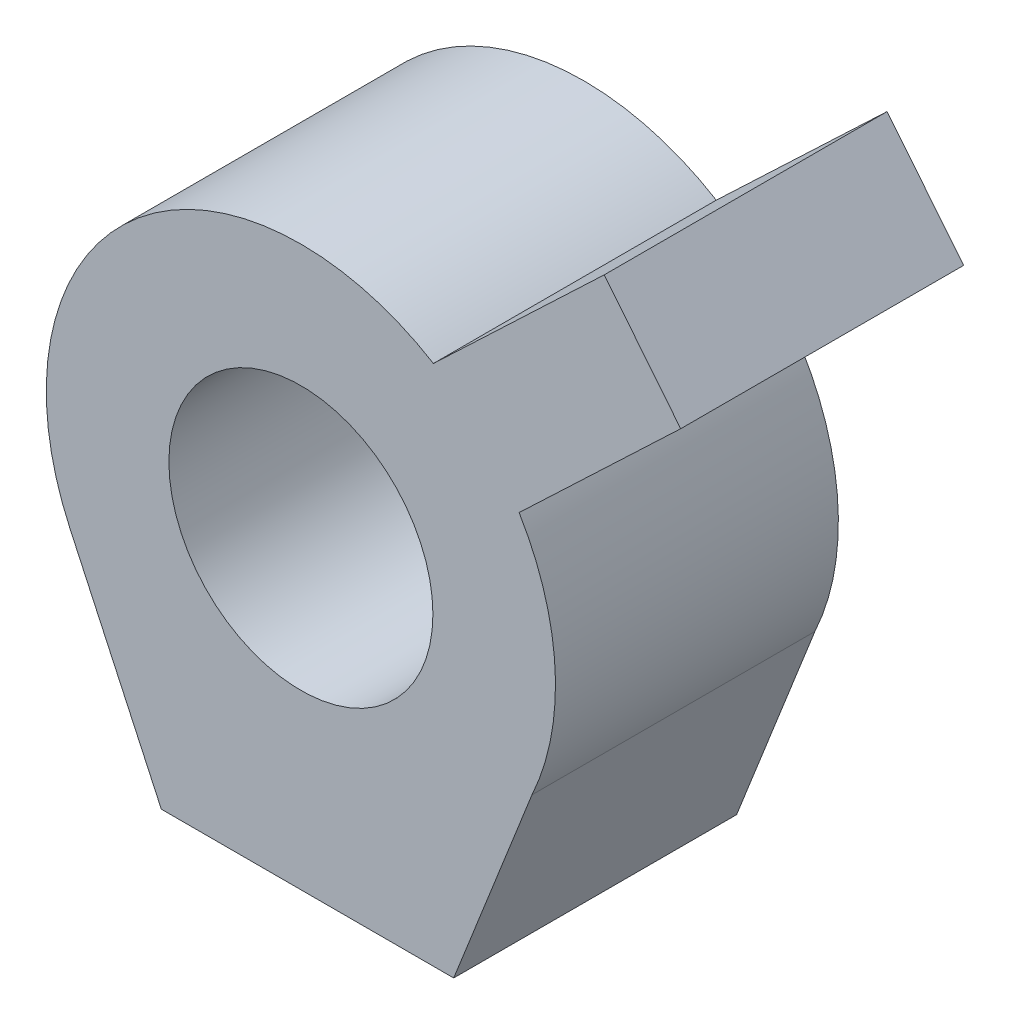
ISO-10303-21;
HEADER;
FILE_DESCRIPTION(('STEP AP214'),'2;1');
FILE_NAME('part.step','',(''),(''),'','','');
FILE_SCHEMA(('AUTOMOTIVE_DESIGN { 1 0 10303 214 1 1 1 1 }'));
ENDSEC;
DATA;
#1=APPLICATION_CONTEXT('core data for automotive mechanical design processes');
#2=APPLICATION_PROTOCOL_DEFINITION('international standard','automotive_design',2000,#1);
#3=PRODUCT_CONTEXT('',#1,'mechanical');
#4=PRODUCT('Part','Part','',(#3));
#5=PRODUCT_RELATED_PRODUCT_CATEGORY('part','',(#4));
#6=PRODUCT_DEFINITION_FORMATION('','',#4);
#7=PRODUCT_DEFINITION_CONTEXT('part definition',#1,'design');
#8=PRODUCT_DEFINITION('design','',#6,#7);
#9=PRODUCT_DEFINITION_SHAPE('','',#8);
#10=(LENGTH_UNIT() NAMED_UNIT(*) SI_UNIT(.MILLI.,.METRE.));
#11=(NAMED_UNIT(*) PLANE_ANGLE_UNIT() SI_UNIT($,.RADIAN.));
#12=(NAMED_UNIT(*) SI_UNIT($,.STERADIAN.) SOLID_ANGLE_UNIT());
#13=UNCERTAINTY_MEASURE_WITH_UNIT(LENGTH_MEASURE(1.E-05),#10,'distance_accuracy_value','');
#14=(GEOMETRIC_REPRESENTATION_CONTEXT(3) GLOBAL_UNCERTAINTY_ASSIGNED_CONTEXT((#13)) GLOBAL_UNIT_ASSIGNED_CONTEXT((#10,
#11,#12)) REPRESENTATION_CONTEXT('',''));
#15=CARTESIAN_POINT('',(0.,0.,0.));
#16=DIRECTION('',(0.,0.,1.));
#17=DIRECTION('',(1.,0.,0.));
#18=AXIS2_PLACEMENT_3D('',#15,#16,#17);
#19=CARTESIAN_POINT('',(0.,0.,23.8125));
#20=DIRECTION('',(0.,0.,1.));
#21=DIRECTION('',(1.,0.,0.));
#22=AXIS2_PLACEMENT_3D('',#19,#20,#21);
#23=PLANE('',#22);
#24=CARTESIAN_POINT('',(0.,0.,23.8125));
#25=DIRECTION('',(0.,0.,1.));
#26=DIRECTION('',(1.,0.,0.));
#27=AXIS2_PLACEMENT_3D('',#24,#25,#26);
#28=CIRCLE('',#27,21.43125);
#29=CARTESIAN_POINT('',(11.1538920492554,18.2999772873099,23.8125));
#30=VERTEX_POINT('',#29);
#31=CARTESIAN_POINT('',(-19.4506025601669,-8.9984741267021,23.8125));
#32=VERTEX_POINT('',#31);
#33=EDGE_CURVE('E164',#30,#32,#28,.T.);
#34=ORIENTED_EDGE('',*,*,#33,.T.);
#35=DIRECTION('',(0.419876308040926,-0.907581338473815,0.));
#36=VECTOR('',#35,1.);
#37=CARTESIAN_POINT('',(-19.4506025601669,-8.9984741267021,23.8125));
#38=LINE('',#37,#36);
#39=CARTESIAN_POINT('',(-11.7497244476854,-25.6442651153864,23.8125));
#40=VERTEX_POINT('',#39);
#41=EDGE_CURVE('E100',#32,#40,#38,.T.);
#42=ORIENTED_EDGE('',*,*,#41,.T.);
#43=DIRECTION('',(1.,0.,0.));
#44=VECTOR('',#43,1.);
#45=CARTESIAN_POINT('',(-11.7497244476854,-25.6442651153864,23.8125));
#46=LINE('',#45,#44);
#47=CARTESIAN_POINT('',(12.86324298528,-25.6442651153864,23.8125));
#48=VERTEX_POINT('',#47);
#49=EDGE_CURVE('E185',#40,#48,#46,.T.);
#50=ORIENTED_EDGE('',*,*,#49,.T.);
#51=DIRECTION('',(0.367971211304057,0.929837183409776,0.));
#52=VECTOR('',#51,1.);
#53=CARTESIAN_POINT('',(12.86324298528,-25.6442651153864,23.8125));
#54=LINE('',#53,#52);
#55=CARTESIAN_POINT('',(19.4506025601669,-8.99847412670211,23.8125));
#56=VERTEX_POINT('',#55);
#57=EDGE_CURVE('E199',#48,#56,#54,.T.);
#58=ORIENTED_EDGE('',*,*,#57,.T.);
#59=CARTESIAN_POINT('',(0.,0.,23.8125));
#60=DIRECTION('',(0.,0.,1.));
#61=DIRECTION('',(1.,0.,0.));
#62=AXIS2_PLACEMENT_3D('',#59,#60,#61);
#63=CIRCLE('',#62,21.43125);
#64=CARTESIAN_POINT('',(18.3692010479282,11.0395167205496,23.8125));
#65=VERTEX_POINT('',#64);
#66=EDGE_CURVE('E119',#56,#65,#63,.T.);
#67=ORIENTED_EDGE('',*,*,#66,.T.);
#68=DIRECTION('',(0.725263803818692,0.688471070467338,0.));
#69=VECTOR('',#68,1.);
#70=CARTESIAN_POINT('',(31.9705409167588,23.9508587315247,23.8125));
#71=LINE('',#70,#69);
#72=CARTESIAN_POINT('',(31.9705409167588,23.9508587315247,23.8125));
#73=VERTEX_POINT('',#72);
#74=EDGE_CURVE('E113',#65,#73,#71,.T.);
#75=ORIENTED_EDGE('',*,*,#74,.T.);
#76=DIRECTION('',(-0.626756914695757,0.779214841928114,0.));
#77=VECTOR('',#76,1.);
#78=CARTESIAN_POINT('',(31.9705409167588,23.9508587315247,23.8125));
#79=LINE('',#78,#77);
#80=CARTESIAN_POINT('',(25.5351405829805,31.9516630884473,23.8125));
#81=VERTEX_POINT('',#80);
#82=EDGE_CURVE('E117',#73,#81,#79,.T.);
#83=ORIENTED_EDGE('',*,*,#82,.T.);
#84=DIRECTION('',(-0.725263803818692,-0.688471070467338,0.));
#85=VECTOR('',#84,1.);
#86=CARTESIAN_POINT('',(11.1538920492554,18.2999772873099,23.8125));
#87=LINE('',#86,#85);
#88=EDGE_CURVE('E57',#81,#30,#87,.T.);
#89=ORIENTED_EDGE('',*,*,#88,.T.);
#90=EDGE_LOOP('',(#34,#42,#50,#58,#67,#75,#83,#89));
#91=FACE_BOUND('',#90,.T.);
#92=CARTESIAN_POINT('',(0.,0.,23.8125));
#93=DIRECTION('',(0.,0.,1.));
#94=DIRECTION('',(1.,0.,0.));
#95=AXIS2_PLACEMENT_3D('',#92,#93,#94);
#96=CIRCLE('',#95,11.1125);
#97=CARTESIAN_POINT('',(11.1125,0.,23.8125));
#98=VERTEX_POINT('',#97);
#99=EDGE_CURVE('E146',#98,#98,#96,.T.);
#100=ORIENTED_EDGE('',*,*,#99,.F.);
#101=EDGE_LOOP('',(#100));
#102=FACE_BOUND('',#101,.T.);
#103=ADVANCED_FACE('F39',(#91,#102),#23,.T.);
#104=CARTESIAN_POINT('',(0.,0.,0.));
#105=DIRECTION('',(0.,0.,1.));
#106=DIRECTION('',(1.,0.,0.));
#107=AXIS2_PLACEMENT_3D('',#104,#105,#106);
#108=PLANE('',#107);
#109=CARTESIAN_POINT('',(0.,0.,0.));
#110=DIRECTION('',(0.,0.,1.));
#111=DIRECTION('',(1.,0.,0.));
#112=AXIS2_PLACEMENT_3D('',#109,#110,#111);
#113=CIRCLE('',#112,21.43125);
#114=CARTESIAN_POINT('',(11.1538920492554,18.2999772873099,0.));
#115=VERTEX_POINT('',#114);
#116=CARTESIAN_POINT('',(-19.4506025601669,-8.9984741267021,0.));
#117=VERTEX_POINT('',#116);
#118=EDGE_CURVE('E141',#115,#117,#113,.T.);
#119=ORIENTED_EDGE('',*,*,#118,.F.);
#120=DIRECTION('',(-0.725263803818692,-0.688471070467338,0.));
#121=VECTOR('',#120,1.);
#122=CARTESIAN_POINT('',(11.1538920492554,18.2999772873099,0.));
#123=LINE('',#122,#121);
#124=CARTESIAN_POINT('',(25.5351405829805,31.9516630884473,0.));
#125=VERTEX_POINT('',#124);
#126=EDGE_CURVE('E92',#125,#115,#123,.T.);
#127=ORIENTED_EDGE('',*,*,#126,.F.);
#128=DIRECTION('',(-0.626756914695757,0.779214841928114,0.));
#129=VECTOR('',#128,1.);
#130=CARTESIAN_POINT('',(31.9705409167588,23.9508587315247,0.));
#131=LINE('',#130,#129);
#132=CARTESIAN_POINT('',(31.9705409167588,23.9508587315247,0.));
#133=VERTEX_POINT('',#132);
#134=EDGE_CURVE('E86',#133,#125,#131,.T.);
#135=ORIENTED_EDGE('',*,*,#134,.F.);
#136=DIRECTION('',(0.725263803818692,0.688471070467338,0.));
#137=VECTOR('',#136,1.);
#138=CARTESIAN_POINT('',(31.9705409167588,23.9508587315247,0.));
#139=LINE('',#138,#137);
#140=CARTESIAN_POINT('',(18.3692010479282,11.0395167205496,0.));
#141=VERTEX_POINT('',#140);
#142=EDGE_CURVE('E128',#141,#133,#139,.T.);
#143=ORIENTED_EDGE('',*,*,#142,.F.);
#144=CARTESIAN_POINT('',(0.,0.,0.));
#145=DIRECTION('',(0.,0.,1.));
#146=DIRECTION('',(1.,0.,0.));
#147=AXIS2_PLACEMENT_3D('',#144,#145,#146);
#148=CIRCLE('',#147,21.43125);
#149=CARTESIAN_POINT('',(19.4506025601669,-8.99847412670211,0.));
#150=VERTEX_POINT('',#149);
#151=EDGE_CURVE('E155',#150,#141,#148,.T.);
#152=ORIENTED_EDGE('',*,*,#151,.F.);
#153=DIRECTION('',(0.367971211304057,0.929837183409776,0.));
#154=VECTOR('',#153,1.);
#155=CARTESIAN_POINT('',(12.86324298528,-25.6442651153864,0.));
#156=LINE('',#155,#154);
#157=CARTESIAN_POINT('',(12.86324298528,-25.6442651153864,0.));
#158=VERTEX_POINT('',#157);
#159=EDGE_CURVE('E152',#158,#150,#156,.T.);
#160=ORIENTED_EDGE('',*,*,#159,.F.);
#161=DIRECTION('',(1.,0.,0.));
#162=VECTOR('',#161,1.);
#163=CARTESIAN_POINT('',(-11.7497244476854,-25.6442651153864,0.));
#164=LINE('',#163,#162);
#165=CARTESIAN_POINT('',(-11.7497244476854,-25.6442651153864,0.));
#166=VERTEX_POINT('',#165);
#167=EDGE_CURVE('E149',#166,#158,#164,.T.);
#168=ORIENTED_EDGE('',*,*,#167,.F.);
#169=DIRECTION('',(0.419876308040926,-0.907581338473815,0.));
#170=VECTOR('',#169,1.);
#171=CARTESIAN_POINT('',(-19.4506025601669,-8.9984741267021,0.));
#172=LINE('',#171,#170);
#173=EDGE_CURVE('E145',#117,#166,#172,.T.);
#174=ORIENTED_EDGE('',*,*,#173,.F.);
#175=EDGE_LOOP('',(#119,#127,#135,#143,#152,#160,#168,#174));
#176=FACE_BOUND('',#175,.T.);
#177=CARTESIAN_POINT('',(0.,0.,0.));
#178=DIRECTION('',(0.,0.,1.));
#179=DIRECTION('',(1.,0.,0.));
#180=AXIS2_PLACEMENT_3D('',#177,#178,#179);
#181=CIRCLE('',#180,11.1125);
#182=CARTESIAN_POINT('',(11.1125,0.,0.));
#183=VERTEX_POINT('',#182);
#184=EDGE_CURVE('E209',#183,#183,#181,.T.);
#185=ORIENTED_EDGE('',*,*,#184,.T.);
#186=EDGE_LOOP('',(#185));
#187=FACE_BOUND('',#186,.T.);
#188=ADVANCED_FACE('F189',(#176,#187),#108,.F.);
#189=CARTESIAN_POINT('',(0.,0.,23.8125));
#190=DIRECTION('',(0.,0.,-1.));
#191=DIRECTION('',(-1.,0.,0.));
#192=AXIS2_PLACEMENT_3D('',#189,#190,#191);
#193=CYLINDRICAL_SURFACE('',#192,21.43125);
#194=ORIENTED_EDGE('',*,*,#118,.T.);
#195=DIRECTION('',(0.,0.,-1.));
#196=VECTOR('',#195,1.);
#197=CARTESIAN_POINT('',(-19.4506025601669,-8.9984741267021,23.8125));
#198=LINE('',#197,#196);
#199=EDGE_CURVE('E11',#32,#117,#198,.T.);
#200=ORIENTED_EDGE('',*,*,#199,.F.);
#201=ORIENTED_EDGE('',*,*,#33,.F.);
#202=DIRECTION('',(0.,0.,-1.));
#203=VECTOR('',#202,1.);
#204=CARTESIAN_POINT('',(11.1538920492554,18.2999772873099,23.8125));
#205=LINE('',#204,#203);
#206=EDGE_CURVE('E137',#30,#115,#205,.T.);
#207=ORIENTED_EDGE('',*,*,#206,.T.);
#208=EDGE_LOOP('',(#194,#200,#201,#207));
#209=FACE_BOUND('',#208,.T.);
#210=ADVANCED_FACE('F41',(#209),#193,.T.);
#211=CARTESIAN_POINT('',(-19.4506025601669,-8.9984741267021,23.8125));
#212=DIRECTION('',(0.907581338473815,0.419876308040926,0.));
#213=DIRECTION('',(-0.419876308040926,0.907581338473815,0.));
#214=AXIS2_PLACEMENT_3D('',#211,#212,#213);
#215=PLANE('',#214);
#216=ORIENTED_EDGE('',*,*,#173,.T.);
#217=DIRECTION('',(0.,0.,-1.));
#218=VECTOR('',#217,1.);
#219=CARTESIAN_POINT('',(-11.7497244476854,-25.6442651153864,23.8125));
#220=LINE('',#219,#218);
#221=EDGE_CURVE('E49',#40,#166,#220,.T.);
#222=ORIENTED_EDGE('',*,*,#221,.F.);
#223=ORIENTED_EDGE('',*,*,#41,.F.);
#224=ORIENTED_EDGE('',*,*,#199,.T.);
#225=EDGE_LOOP('',(#216,#222,#223,#224));
#226=FACE_BOUND('',#225,.T.);
#227=ADVANCED_FACE('F239',(#226),#215,.F.);
#228=CARTESIAN_POINT('',(-11.7497244476854,-25.6442651153864,23.8125));
#229=DIRECTION('',(0.,1.,0.));
#230=DIRECTION('',(0.,0.,1.));
#231=AXIS2_PLACEMENT_3D('',#228,#229,#230);
#232=PLANE('',#231);
#233=ORIENTED_EDGE('',*,*,#167,.T.);
#234=DIRECTION('',(0.,0.,-1.));
#235=VECTOR('',#234,1.);
#236=CARTESIAN_POINT('',(12.86324298528,-25.6442651153864,23.8125));
#237=LINE('',#236,#235);
#238=EDGE_CURVE('E175',#48,#158,#237,.T.);
#239=ORIENTED_EDGE('',*,*,#238,.F.);
#240=ORIENTED_EDGE('',*,*,#49,.F.);
#241=ORIENTED_EDGE('',*,*,#221,.T.);
#242=EDGE_LOOP('',(#233,#239,#240,#241));
#243=FACE_BOUND('',#242,.T.);
#244=ADVANCED_FACE('F183',(#243),#232,.F.);
#245=CARTESIAN_POINT('',(12.86324298528,-25.6442651153864,23.8125));
#246=DIRECTION('',(-0.929837183409776,0.367971211304057,0.));
#247=DIRECTION('',(-0.367971211304057,-0.929837183409776,0.));
#248=AXIS2_PLACEMENT_3D('',#245,#246,#247);
#249=PLANE('',#248);
#250=ORIENTED_EDGE('',*,*,#159,.T.);
#251=DIRECTION('',(0.,0.,-1.));
#252=VECTOR('',#251,1.);
#253=CARTESIAN_POINT('',(19.4506025601669,-8.99847412670211,23.8125));
#254=LINE('',#253,#252);
#255=EDGE_CURVE('E171',#56,#150,#254,.T.);
#256=ORIENTED_EDGE('',*,*,#255,.F.);
#257=ORIENTED_EDGE('',*,*,#57,.F.);
#258=ORIENTED_EDGE('',*,*,#238,.T.);
#259=EDGE_LOOP('',(#250,#256,#257,#258));
#260=FACE_BOUND('',#259,.T.);
#261=ADVANCED_FACE('F194',(#260),#249,.F.);
#262=CARTESIAN_POINT('',(0.,0.,23.8125));
#263=DIRECTION('',(0.,0.,-1.));
#264=DIRECTION('',(-1.,0.,0.));
#265=AXIS2_PLACEMENT_3D('',#262,#263,#264);
#266=CYLINDRICAL_SURFACE('',#265,21.43125);
#267=ORIENTED_EDGE('',*,*,#151,.T.);
#268=DIRECTION('',(0.,0.,-1.));
#269=VECTOR('',#268,1.);
#270=CARTESIAN_POINT('',(18.3692010479282,11.0395167205496,23.8125));
#271=LINE('',#270,#269);
#272=EDGE_CURVE('E130',#65,#141,#271,.T.);
#273=ORIENTED_EDGE('',*,*,#272,.F.);
#274=ORIENTED_EDGE('',*,*,#66,.F.);
#275=ORIENTED_EDGE('',*,*,#255,.T.);
#276=EDGE_LOOP('',(#267,#273,#274,#275));
#277=FACE_BOUND('',#276,.T.);
#278=ADVANCED_FACE('F197',(#277),#266,.T.);
#279=CARTESIAN_POINT('',(31.9705409167588,23.9508587315247,23.8125));
#280=DIRECTION('',(-0.688471070467338,0.725263803818692,0.));
#281=DIRECTION('',(-0.725263803818692,-0.688471070467338,0.));
#282=AXIS2_PLACEMENT_3D('',#279,#280,#281);
#283=PLANE('',#282);
#284=ORIENTED_EDGE('',*,*,#142,.T.);
#285=DIRECTION('',(0.,0.,-1.));
#286=VECTOR('',#285,1.);
#287=CARTESIAN_POINT('',(31.9705409167588,23.9508587315247,23.8125));
#288=LINE('',#287,#286);
#289=EDGE_CURVE('E125',#73,#133,#288,.T.);
#290=ORIENTED_EDGE('',*,*,#289,.F.);
#291=ORIENTED_EDGE('',*,*,#74,.F.);
#292=ORIENTED_EDGE('',*,*,#272,.T.);
#293=EDGE_LOOP('',(#284,#290,#291,#292));
#294=FACE_BOUND('',#293,.T.);
#295=ADVANCED_FACE('F126',(#294),#283,.F.);
#296=CARTESIAN_POINT('',(31.9705409167588,23.9508587315247,23.8125));
#297=DIRECTION('',(-0.779214841928114,-0.626756914695757,0.));
#298=DIRECTION('',(0.626756914695757,-0.779214841928114,0.));
#299=AXIS2_PLACEMENT_3D('',#296,#297,#298);
#300=PLANE('',#299);
#301=ORIENTED_EDGE('',*,*,#134,.T.);
#302=DIRECTION('',(0.,0.,-1.));
#303=VECTOR('',#302,1.);
#304=CARTESIAN_POINT('',(25.5351405829805,31.9516630884473,23.8125));
#305=LINE('',#304,#303);
#306=EDGE_CURVE('E131',#81,#125,#305,.T.);
#307=ORIENTED_EDGE('',*,*,#306,.F.);
#308=ORIENTED_EDGE('',*,*,#82,.F.);
#309=ORIENTED_EDGE('',*,*,#289,.T.);
#310=EDGE_LOOP('',(#301,#307,#308,#309));
#311=FACE_BOUND('',#310,.T.);
#312=ADVANCED_FACE('F133',(#311),#300,.F.);
#313=CARTESIAN_POINT('',(11.1538920492554,18.2999772873099,23.8125));
#314=DIRECTION('',(0.688471070467338,-0.725263803818692,0.));
#315=DIRECTION('',(0.725263803818692,0.688471070467338,0.));
#316=AXIS2_PLACEMENT_3D('',#313,#314,#315);
#317=PLANE('',#316);
#318=ORIENTED_EDGE('',*,*,#126,.T.);
#319=ORIENTED_EDGE('',*,*,#206,.F.);
#320=ORIENTED_EDGE('',*,*,#88,.F.);
#321=ORIENTED_EDGE('',*,*,#306,.T.);
#322=EDGE_LOOP('',(#318,#319,#320,#321));
#323=FACE_BOUND('',#322,.T.);
#324=ADVANCED_FACE('F227',(#323),#317,.F.);
#325=CARTESIAN_POINT('',(0.,0.,23.8125));
#326=DIRECTION('',(0.,0.,-1.));
#327=DIRECTION('',(-1.,0.,0.));
#328=AXIS2_PLACEMENT_3D('',#325,#326,#327);
#329=CYLINDRICAL_SURFACE('',#328,11.1125);
#330=ORIENTED_EDGE('',*,*,#99,.T.);
#331=EDGE_LOOP('',(#330));
#332=FACE_BOUND('',#331,.T.);
#333=ORIENTED_EDGE('',*,*,#184,.F.);
#334=EDGE_LOOP('',(#333));
#335=FACE_BOUND('',#334,.T.);
#336=ADVANCED_FACE('F217',(#332,#335),#329,.F.);
#337=CLOSED_SHELL('',(#103,#188,#210,#227,#244,#261,#278,#295,#312,#324,#336));
#338=MANIFOLD_SOLID_BREP('B2',#337);
#339=ADVANCED_BREP_SHAPE_REPRESENTATION('',(#18,#338),#14);
#340=SHAPE_DEFINITION_REPRESENTATION(#9,#339);
ENDSEC;
END-ISO-10303-21;
